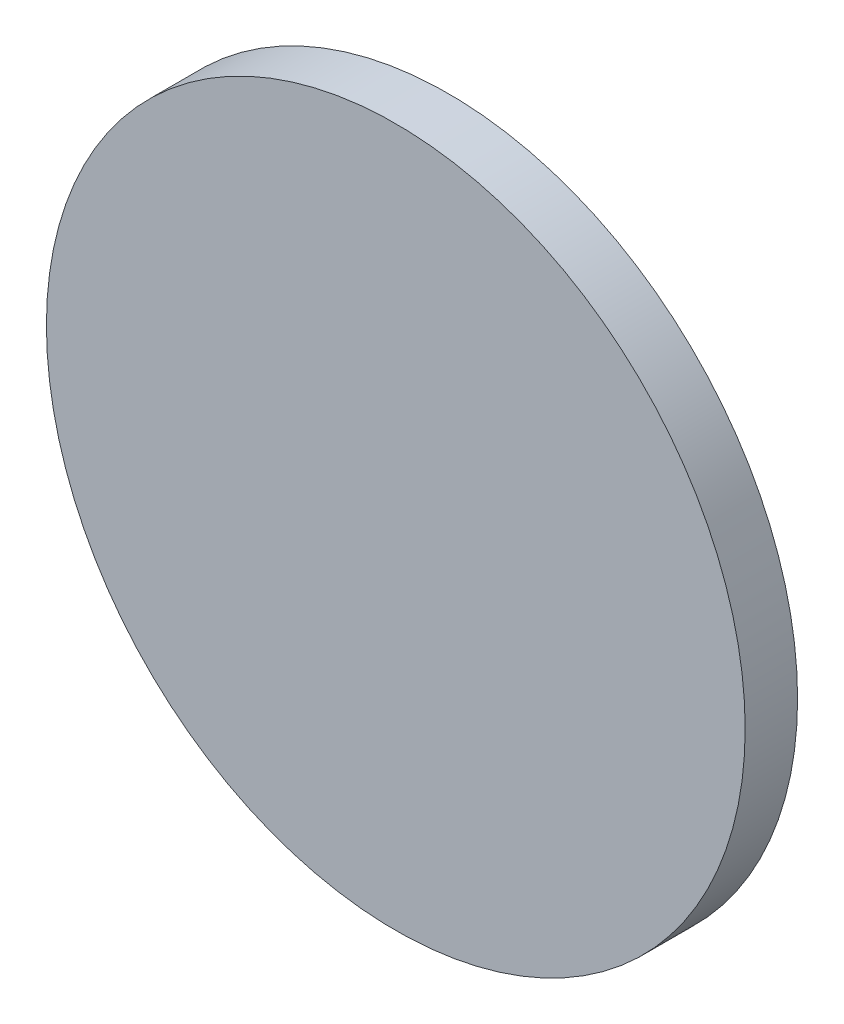
ISO-10303-21;
HEADER;
FILE_DESCRIPTION(('STEP AP214'),'2;1');
FILE_NAME('part.step','',(''),(''),'','','');
FILE_SCHEMA(('AUTOMOTIVE_DESIGN { 1 0 10303 214 1 1 1 1 }'));
ENDSEC;
DATA;
#1=APPLICATION_CONTEXT('core data for automotive mechanical design processes');
#2=APPLICATION_PROTOCOL_DEFINITION('international standard','automotive_design',2000,#1);
#3=PRODUCT_CONTEXT('',#1,'mechanical');
#4=PRODUCT('Part','Part','',(#3));
#5=PRODUCT_RELATED_PRODUCT_CATEGORY('part','',(#4));
#6=PRODUCT_DEFINITION_FORMATION('','',#4);
#7=PRODUCT_DEFINITION_CONTEXT('part definition',#1,'design');
#8=PRODUCT_DEFINITION('design','',#6,#7);
#9=PRODUCT_DEFINITION_SHAPE('','',#8);
#10=(LENGTH_UNIT() NAMED_UNIT(*) SI_UNIT(.MILLI.,.METRE.));
#11=(NAMED_UNIT(*) PLANE_ANGLE_UNIT() SI_UNIT($,.RADIAN.));
#12=(NAMED_UNIT(*) SI_UNIT($,.STERADIAN.) SOLID_ANGLE_UNIT());
#13=UNCERTAINTY_MEASURE_WITH_UNIT(LENGTH_MEASURE(1.E-05),#10,'distance_accuracy_value','');
#14=(GEOMETRIC_REPRESENTATION_CONTEXT(3) GLOBAL_UNCERTAINTY_ASSIGNED_CONTEXT((#13)) GLOBAL_UNIT_ASSIGNED_CONTEXT((#10,
#11,#12)) REPRESENTATION_CONTEXT('',''));
#15=CARTESIAN_POINT('',(0.,0.,0.));
#16=DIRECTION('',(0.,0.,1.));
#17=DIRECTION('',(1.,0.,0.));
#18=AXIS2_PLACEMENT_3D('',#15,#16,#17);
#19=CARTESIAN_POINT('',(0.,0.,3.));
#20=DIRECTION('',(0.,0.,-1.));
#21=DIRECTION('',(-1.,0.,0.));
#22=AXIS2_PLACEMENT_3D('',#19,#20,#21);
#23=CYLINDRICAL_SURFACE('',#22,20.);
#24=CARTESIAN_POINT('',(0.,0.,3.));
#25=DIRECTION('',(0.,0.,1.));
#26=DIRECTION('',(1.,0.,0.));
#27=AXIS2_PLACEMENT_3D('',#24,#25,#26);
#28=CIRCLE('',#27,20.);
#29=CARTESIAN_POINT('',(20.,0.,3.));
#30=VERTEX_POINT('',#29);
#31=EDGE_CURVE('E10',#30,#30,#28,.T.);
#32=ORIENTED_EDGE('',*,*,#31,.F.);
#33=EDGE_LOOP('',(#32));
#34=FACE_BOUND('',#33,.T.);
#35=CARTESIAN_POINT('',(0.,0.,0.));
#36=DIRECTION('',(0.,0.,1.));
#37=DIRECTION('',(1.,0.,0.));
#38=AXIS2_PLACEMENT_3D('',#35,#36,#37);
#39=CIRCLE('',#38,20.);
#40=CARTESIAN_POINT('',(20.,0.,0.));
#41=VERTEX_POINT('',#40);
#42=EDGE_CURVE('E33',#41,#41,#39,.T.);
#43=ORIENTED_EDGE('',*,*,#42,.T.);
#44=EDGE_LOOP('',(#43));
#45=FACE_BOUND('',#44,.T.);
#46=ADVANCED_FACE('F30',(#34,#45),#23,.T.);
#47=CARTESIAN_POINT('',(0.,0.,3.));
#48=DIRECTION('',(0.,0.,1.));
#49=DIRECTION('',(1.,0.,0.));
#50=AXIS2_PLACEMENT_3D('',#47,#48,#49);
#51=PLANE('',#50);
#52=ORIENTED_EDGE('',*,*,#31,.T.);
#53=EDGE_LOOP('',(#52));
#54=FACE_BOUND('',#53,.T.);
#55=ADVANCED_FACE('F45',(#54),#51,.T.);
#56=CARTESIAN_POINT('',(0.,0.,0.));
#57=DIRECTION('',(0.,0.,1.));
#58=DIRECTION('',(1.,0.,0.));
#59=AXIS2_PLACEMENT_3D('',#56,#57,#58);
#60=PLANE('',#59);
#61=ORIENTED_EDGE('',*,*,#42,.F.);
#62=EDGE_LOOP('',(#61));
#63=FACE_BOUND('',#62,.T.);
#64=ADVANCED_FACE('F43',(#63),#60,.F.);
#65=CLOSED_SHELL('',(#46,#55,#64));
#66=MANIFOLD_SOLID_BREP('B2',#65);
#67=ADVANCED_BREP_SHAPE_REPRESENTATION('',(#18,#66),#14);
#68=SHAPE_DEFINITION_REPRESENTATION(#9,#67);
ENDSEC;
END-ISO-10303-21;
